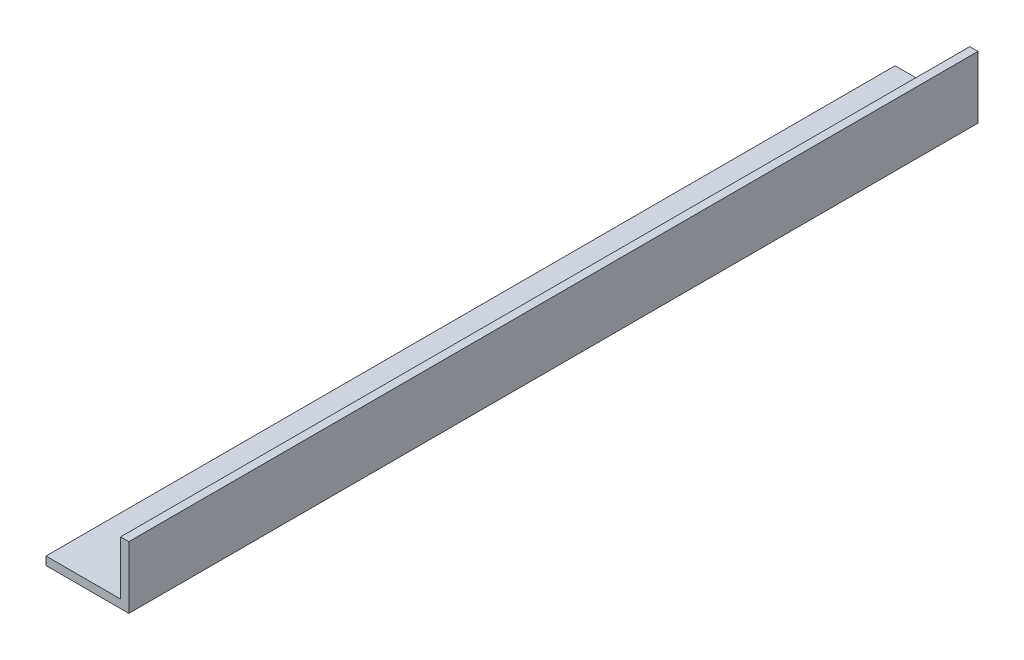
ISO-10303-21;
HEADER;
FILE_DESCRIPTION(('STEP AP214'),'2;1');
FILE_NAME('part.step','',(''),(''),'','','');
FILE_SCHEMA(('AUTOMOTIVE_DESIGN { 1 0 10303 214 1 1 1 1 }'));
ENDSEC;
DATA;
#1=APPLICATION_CONTEXT('core data for automotive mechanical design processes');
#2=APPLICATION_PROTOCOL_DEFINITION('international standard','automotive_design',2000,#1);
#3=PRODUCT_CONTEXT('',#1,'mechanical');
#4=PRODUCT('Part','Part','',(#3));
#5=PRODUCT_RELATED_PRODUCT_CATEGORY('part','',(#4));
#6=PRODUCT_DEFINITION_FORMATION('','',#4);
#7=PRODUCT_DEFINITION_CONTEXT('part definition',#1,'design');
#8=PRODUCT_DEFINITION('design','',#6,#7);
#9=PRODUCT_DEFINITION_SHAPE('','',#8);
#10=(LENGTH_UNIT() NAMED_UNIT(*) SI_UNIT(.MILLI.,.METRE.));
#11=(NAMED_UNIT(*) PLANE_ANGLE_UNIT() SI_UNIT($,.RADIAN.));
#12=(NAMED_UNIT(*) SI_UNIT($,.STERADIAN.) SOLID_ANGLE_UNIT());
#13=UNCERTAINTY_MEASURE_WITH_UNIT(LENGTH_MEASURE(1.E-05),#10,'distance_accuracy_value','');
#14=(GEOMETRIC_REPRESENTATION_CONTEXT(3) GLOBAL_UNCERTAINTY_ASSIGNED_CONTEXT((#13)) GLOBAL_UNIT_ASSIGNED_CONTEXT((#10,
#11,#12)) REPRESENTATION_CONTEXT('',''));
#15=CARTESIAN_POINT('',(0.,0.,0.));
#16=DIRECTION('',(0.,0.,1.));
#17=DIRECTION('',(1.,0.,0.));
#18=AXIS2_PLACEMENT_3D('',#15,#16,#17);
#19=CARTESIAN_POINT('',(0.,2.,205.));
#20=DIRECTION('',(1.,0.,0.));
#21=DIRECTION('',(0.,1.,0.));
#22=AXIS2_PLACEMENT_3D('',#19,#20,#21);
#23=PLANE('',#22);
#24=DIRECTION('',(0.,-1.,0.));
#25=VECTOR('',#24,1.);
#26=CARTESIAN_POINT('',(0.,2.,0.));
#27=LINE('',#26,#25);
#28=CARTESIAN_POINT('',(0.,2.,0.));
#29=VERTEX_POINT('',#28);
#30=CARTESIAN_POINT('',(0.,0.,0.));
#31=VERTEX_POINT('',#30);
#32=EDGE_CURVE('E116',#29,#31,#27,.T.);
#33=ORIENTED_EDGE('',*,*,#32,.T.);
#34=DIRECTION('',(0.,0.,-1.));
#35=VECTOR('',#34,1.);
#36=CARTESIAN_POINT('',(0.,0.,205.));
#37=LINE('',#36,#35);
#38=CARTESIAN_POINT('',(0.,0.,205.));
#39=VERTEX_POINT('',#38);
#40=EDGE_CURVE('E11',#39,#31,#37,.T.);
#41=ORIENTED_EDGE('',*,*,#40,.F.);
#42=DIRECTION('',(0.,-1.,0.));
#43=VECTOR('',#42,1.);
#44=CARTESIAN_POINT('',(0.,2.,205.));
#45=LINE('',#44,#43);
#46=CARTESIAN_POINT('',(0.,2.,205.));
#47=VERTEX_POINT('',#46);
#48=EDGE_CURVE('E126',#47,#39,#45,.T.);
#49=ORIENTED_EDGE('',*,*,#48,.F.);
#50=DIRECTION('',(0.,0.,-1.));
#51=VECTOR('',#50,1.);
#52=CARTESIAN_POINT('',(0.,2.,205.));
#53=LINE('',#52,#51);
#54=EDGE_CURVE('E112',#47,#29,#53,.T.);
#55=ORIENTED_EDGE('',*,*,#54,.T.);
#56=EDGE_LOOP('',(#33,#41,#49,#55));
#57=FACE_BOUND('',#56,.T.);
#58=ADVANCED_FACE('F32',(#57),#23,.F.);
#59=CARTESIAN_POINT('',(0.,0.,205.));
#60=DIRECTION('',(0.,1.,0.));
#61=DIRECTION('',(0.,0.,1.));
#62=AXIS2_PLACEMENT_3D('',#59,#60,#61);
#63=PLANE('',#62);
#64=DIRECTION('',(1.,0.,0.));
#65=VECTOR('',#64,1.);
#66=CARTESIAN_POINT('',(0.,0.,0.));
#67=LINE('',#66,#65);
#68=CARTESIAN_POINT('',(20.,0.,0.));
#69=VERTEX_POINT('',#68);
#70=EDGE_CURVE('E119',#31,#69,#67,.T.);
#71=ORIENTED_EDGE('',*,*,#70,.T.);
#72=DIRECTION('',(0.,0.,-1.));
#73=VECTOR('',#72,1.);
#74=CARTESIAN_POINT('',(20.,0.,205.));
#75=LINE('',#74,#73);
#76=CARTESIAN_POINT('',(20.,0.,205.));
#77=VERTEX_POINT('',#76);
#78=EDGE_CURVE('E40',#77,#69,#75,.T.);
#79=ORIENTED_EDGE('',*,*,#78,.F.);
#80=DIRECTION('',(1.,0.,0.));
#81=VECTOR('',#80,1.);
#82=CARTESIAN_POINT('',(0.,0.,205.));
#83=LINE('',#82,#81);
#84=EDGE_CURVE('E85',#39,#77,#83,.T.);
#85=ORIENTED_EDGE('',*,*,#84,.F.);
#86=ORIENTED_EDGE('',*,*,#40,.T.);
#87=EDGE_LOOP('',(#71,#79,#85,#86));
#88=FACE_BOUND('',#87,.T.);
#89=ADVANCED_FACE('F150',(#88),#63,.F.);
#90=CARTESIAN_POINT('',(20.,0.,205.));
#91=DIRECTION('',(-1.,0.,0.));
#92=DIRECTION('',(0.,0.,1.));
#93=AXIS2_PLACEMENT_3D('',#90,#91,#92);
#94=PLANE('',#93);
#95=DIRECTION('',(0.,1.,0.));
#96=VECTOR('',#95,1.);
#97=CARTESIAN_POINT('',(20.,0.,0.));
#98=LINE('',#97,#96);
#99=CARTESIAN_POINT('',(20.,15.,0.));
#100=VERTEX_POINT('',#99);
#101=EDGE_CURVE('E121',#69,#100,#98,.T.);
#102=ORIENTED_EDGE('',*,*,#101,.T.);
#103=DIRECTION('',(0.,0.,-1.));
#104=VECTOR('',#103,1.);
#105=CARTESIAN_POINT('',(20.,15.,205.));
#106=LINE('',#105,#104);
#107=CARTESIAN_POINT('',(20.,15.,205.));
#108=VERTEX_POINT('',#107);
#109=EDGE_CURVE('E107',#108,#100,#106,.T.);
#110=ORIENTED_EDGE('',*,*,#109,.F.);
#111=DIRECTION('',(0.,1.,0.));
#112=VECTOR('',#111,1.);
#113=CARTESIAN_POINT('',(20.,0.,205.));
#114=LINE('',#113,#112);
#115=EDGE_CURVE('E98',#77,#108,#114,.T.);
#116=ORIENTED_EDGE('',*,*,#115,.F.);
#117=ORIENTED_EDGE('',*,*,#78,.T.);
#118=EDGE_LOOP('',(#102,#110,#116,#117));
#119=FACE_BOUND('',#118,.T.);
#120=ADVANCED_FACE('F132',(#119),#94,.F.);
#121=CARTESIAN_POINT('',(20.,15.,205.));
#122=DIRECTION('',(0.,-1.,0.));
#123=DIRECTION('',(0.,0.,-1.));
#124=AXIS2_PLACEMENT_3D('',#121,#122,#123);
#125=PLANE('',#124);
#126=DIRECTION('',(-1.,0.,0.));
#127=VECTOR('',#126,1.);
#128=CARTESIAN_POINT('',(20.,15.,0.));
#129=LINE('',#128,#127);
#130=CARTESIAN_POINT('',(18.,15.,0.));
#131=VERTEX_POINT('',#130);
#132=EDGE_CURVE('E106',#100,#131,#129,.T.);
#133=ORIENTED_EDGE('',*,*,#132,.T.);
#134=DIRECTION('',(0.,0.,-1.));
#135=VECTOR('',#134,1.);
#136=CARTESIAN_POINT('',(18.,15.,205.));
#137=LINE('',#136,#135);
#138=CARTESIAN_POINT('',(18.,15.,205.));
#139=VERTEX_POINT('',#138);
#140=EDGE_CURVE('E103',#139,#131,#137,.T.);
#141=ORIENTED_EDGE('',*,*,#140,.F.);
#142=DIRECTION('',(-1.,0.,0.));
#143=VECTOR('',#142,1.);
#144=CARTESIAN_POINT('',(20.,15.,205.));
#145=LINE('',#144,#143);
#146=EDGE_CURVE('E92',#108,#139,#145,.T.);
#147=ORIENTED_EDGE('',*,*,#146,.F.);
#148=ORIENTED_EDGE('',*,*,#109,.T.);
#149=EDGE_LOOP('',(#133,#141,#147,#148));
#150=FACE_BOUND('',#149,.T.);
#151=ADVANCED_FACE('F104',(#150),#125,.F.);
#152=CARTESIAN_POINT('',(18.,15.,205.));
#153=DIRECTION('',(1.,0.,0.));
#154=DIRECTION('',(0.,0.,-1.));
#155=AXIS2_PLACEMENT_3D('',#152,#153,#154);
#156=PLANE('',#155);
#157=DIRECTION('',(0.,-1.,0.));
#158=VECTOR('',#157,1.);
#159=CARTESIAN_POINT('',(18.,15.,0.));
#160=LINE('',#159,#158);
#161=CARTESIAN_POINT('',(18.,2.,0.));
#162=VERTEX_POINT('',#161);
#163=EDGE_CURVE('E71',#131,#162,#160,.T.);
#164=ORIENTED_EDGE('',*,*,#163,.T.);
#165=DIRECTION('',(0.,0.,-1.));
#166=VECTOR('',#165,1.);
#167=CARTESIAN_POINT('',(18.,2.,205.));
#168=LINE('',#167,#166);
#169=CARTESIAN_POINT('',(18.,2.,205.));
#170=VERTEX_POINT('',#169);
#171=EDGE_CURVE('E108',#170,#162,#168,.T.);
#172=ORIENTED_EDGE('',*,*,#171,.F.);
#173=DIRECTION('',(0.,-1.,0.));
#174=VECTOR('',#173,1.);
#175=CARTESIAN_POINT('',(18.,15.,205.));
#176=LINE('',#175,#174);
#177=EDGE_CURVE('E96',#139,#170,#176,.T.);
#178=ORIENTED_EDGE('',*,*,#177,.F.);
#179=ORIENTED_EDGE('',*,*,#140,.T.);
#180=EDGE_LOOP('',(#164,#172,#178,#179));
#181=FACE_BOUND('',#180,.T.);
#182=ADVANCED_FACE('F110',(#181),#156,.F.);
#183=CARTESIAN_POINT('',(18.,2.,205.));
#184=DIRECTION('',(0.,-1.,0.));
#185=DIRECTION('',(1.,0.,0.));
#186=AXIS2_PLACEMENT_3D('',#183,#184,#185);
#187=PLANE('',#186);
#188=DIRECTION('',(-1.,0.,0.));
#189=VECTOR('',#188,1.);
#190=CARTESIAN_POINT('',(18.,2.,0.));
#191=LINE('',#190,#189);
#192=EDGE_CURVE('E77',#162,#29,#191,.T.);
#193=ORIENTED_EDGE('',*,*,#192,.T.);
#194=ORIENTED_EDGE('',*,*,#54,.F.);
#195=DIRECTION('',(-1.,0.,0.));
#196=VECTOR('',#195,1.);
#197=CARTESIAN_POINT('',(18.,2.,205.));
#198=LINE('',#197,#196);
#199=EDGE_CURVE('E48',#170,#47,#198,.T.);
#200=ORIENTED_EDGE('',*,*,#199,.F.);
#201=ORIENTED_EDGE('',*,*,#171,.T.);
#202=EDGE_LOOP('',(#193,#194,#200,#201));
#203=FACE_BOUND('',#202,.T.);
#204=ADVANCED_FACE('F139',(#203),#187,.F.);
#205=CARTESIAN_POINT('',(0.,0.,205.));
#206=DIRECTION('',(0.,0.,1.));
#207=DIRECTION('',(1.,0.,0.));
#208=AXIS2_PLACEMENT_3D('',#205,#206,#207);
#209=PLANE('',#208);
#210=ORIENTED_EDGE('',*,*,#48,.T.);
#211=ORIENTED_EDGE('',*,*,#84,.T.);
#212=ORIENTED_EDGE('',*,*,#115,.T.);
#213=ORIENTED_EDGE('',*,*,#146,.T.);
#214=ORIENTED_EDGE('',*,*,#177,.T.);
#215=ORIENTED_EDGE('',*,*,#199,.T.);
#216=EDGE_LOOP('',(#210,#211,#212,#213,#214,#215));
#217=FACE_BOUND('',#216,.T.);
#218=ADVANCED_FACE('F94',(#217),#209,.T.);
#219=CARTESIAN_POINT('',(0.,0.,0.));
#220=DIRECTION('',(0.,0.,1.));
#221=DIRECTION('',(1.,0.,0.));
#222=AXIS2_PLACEMENT_3D('',#219,#220,#221);
#223=PLANE('',#222);
#224=ORIENTED_EDGE('',*,*,#32,.F.);
#225=ORIENTED_EDGE('',*,*,#192,.F.);
#226=ORIENTED_EDGE('',*,*,#163,.F.);
#227=ORIENTED_EDGE('',*,*,#132,.F.);
#228=ORIENTED_EDGE('',*,*,#101,.F.);
#229=ORIENTED_EDGE('',*,*,#70,.F.);
#230=EDGE_LOOP('',(#224,#225,#226,#227,#228,#229));
#231=FACE_BOUND('',#230,.T.);
#232=ADVANCED_FACE('F135',(#231),#223,.F.);
#233=CLOSED_SHELL('',(#58,#89,#120,#151,#182,#204,#218,#232));
#234=MANIFOLD_SOLID_BREP('B2',#233);
#235=ADVANCED_BREP_SHAPE_REPRESENTATION('',(#18,#234),#14);
#236=SHAPE_DEFINITION_REPRESENTATION(#9,#235);
ENDSEC;
END-ISO-10303-21;
